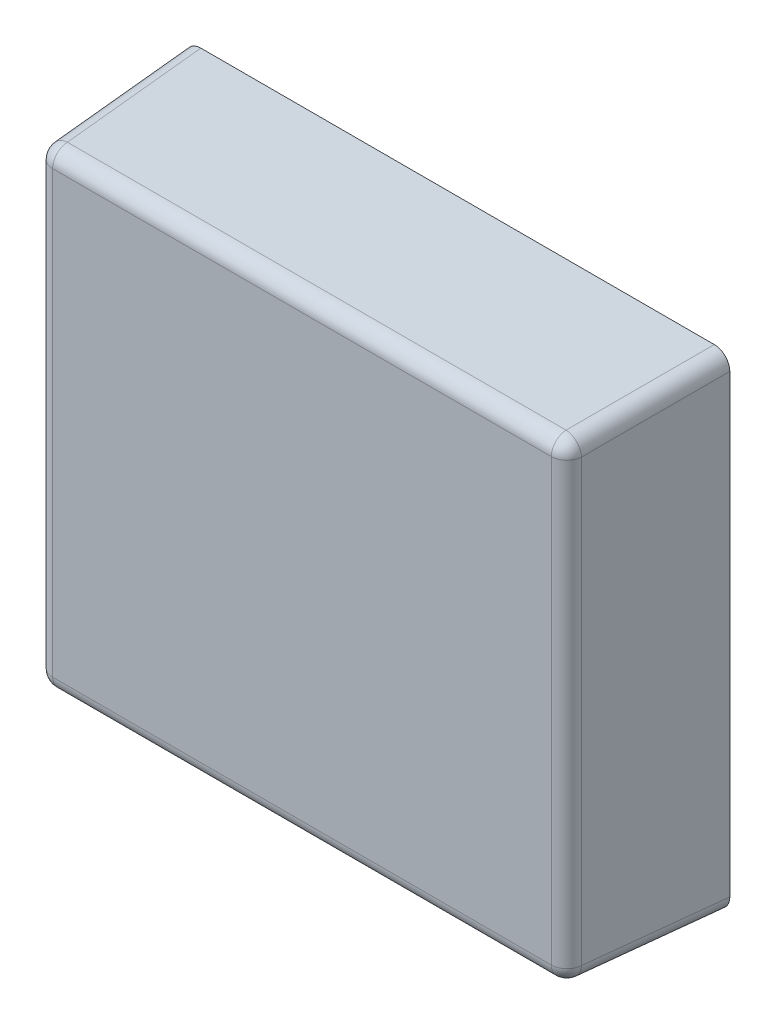
ISO-10303-21;
HEADER;
FILE_DESCRIPTION(('STEP AP214'),'2;1');
FILE_NAME('part.step','',(''),(''),'','','');
FILE_SCHEMA(('AUTOMOTIVE_DESIGN { 1 0 10303 214 1 1 1 1 }'));
ENDSEC;
DATA;
#1=APPLICATION_CONTEXT('core data for automotive mechanical design processes');
#2=APPLICATION_PROTOCOL_DEFINITION('international standard','automotive_design',2000,#1);
#3=PRODUCT_CONTEXT('',#1,'mechanical');
#4=PRODUCT('Part','Part','',(#3));
#5=PRODUCT_RELATED_PRODUCT_CATEGORY('part','',(#4));
#6=PRODUCT_DEFINITION_FORMATION('','',#4);
#7=PRODUCT_DEFINITION_CONTEXT('part definition',#1,'design');
#8=PRODUCT_DEFINITION('design','',#6,#7);
#9=PRODUCT_DEFINITION_SHAPE('','',#8);
#10=(LENGTH_UNIT() NAMED_UNIT(*) SI_UNIT(.MILLI.,.METRE.));
#11=(NAMED_UNIT(*) PLANE_ANGLE_UNIT() SI_UNIT($,.RADIAN.));
#12=(NAMED_UNIT(*) SI_UNIT($,.STERADIAN.) SOLID_ANGLE_UNIT());
#13=UNCERTAINTY_MEASURE_WITH_UNIT(LENGTH_MEASURE(1.E-05),#10,'distance_accuracy_value','');
#14=(GEOMETRIC_REPRESENTATION_CONTEXT(3) GLOBAL_UNCERTAINTY_ASSIGNED_CONTEXT((#13)) GLOBAL_UNIT_ASSIGNED_CONTEXT((#10,
#11,#12)) REPRESENTATION_CONTEXT('',''));
#15=CARTESIAN_POINT('',(0.,0.,0.));
#16=DIRECTION('',(0.,0.,1.));
#17=DIRECTION('',(1.,0.,0.));
#18=AXIS2_PLACEMENT_3D('',#15,#16,#17);
#19=CARTESIAN_POINT('',(0.658251832404,0.583251832404,0.03230958799243));
#20=DIRECTION('',(0.0522644276886878,0.0522644276887224,-0.997264688634238));
#21=DIRECTION('',(-0.998629534754575,0.,-0.0523359562429177));
#22=AXIS2_PLACEMENT_3D('',#19,#20,#21);
#23=CYLINDRICAL_SURFACE('',#22,0.04);
#24=CARTESIAN_POINT('',(0.641078305618,0.566078305618,0.36));
#25=DIRECTION('',(-0.0522644276886878,-0.0522644276887224,0.997264688634238));
#26=DIRECTION('',(0.998629534754575,0.,0.0523359562429177));
#27=AXIS2_PLACEMENT_3D('',#24,#25,#26);
#28=CIRCLE('',#27,0.04);
#29=CARTESIAN_POINT('',(0.681023487008,0.566078305618,0.36209343825));
#30=VERTEX_POINT('',#29);
#31=CARTESIAN_POINT('',(0.641078305618,0.606023487008,0.36209343825));
#32=VERTEX_POINT('',#31);
#33=EDGE_CURVE('E11',#30,#32,#28,.T.);
#34=ORIENTED_EDGE('',*,*,#33,.F.);
#35=DIRECTION('',(-0.0522644276887224,-0.0522644276887224,0.997264688634237));
#36=VECTOR('',#35,1.);
#37=CARTESIAN_POINT('',(0.698401881574,0.583456700184,0.03049391612672));
#38=LINE('',#37,#36);
#39=CARTESIAN_POINT('',(0.7,0.58505481861,0.));
#40=VERTEX_POINT('',#39);
#41=EDGE_CURVE('E167',#40,#30,#38,.T.);
#42=ORIENTED_EDGE('',*,*,#41,.F.);
#43=CARTESIAN_POINT('',(0.65994510616,0.58494510616,0.));
#44=DIRECTION('',(0.,0.,1.));
#45=DIRECTION('',(0.707106781186548,0.707106781186548,0.));
#46=AXIS2_PLACEMENT_3D('',#43,#44,#45);
#47=ELLIPSE('',#46,0.04010971255262,0.04);
#48=CARTESIAN_POINT('',(0.66005481861,0.625,0.));
#49=VERTEX_POINT('',#48);
#50=EDGE_CURVE('E133',#40,#49,#47,.T.);
#51=ORIENTED_EDGE('',*,*,#50,.T.);
#52=DIRECTION('',(-0.0522644276887224,-0.0522644276887224,0.997264688634237));
#53=VECTOR('',#52,1.);
#54=CARTESIAN_POINT('',(0.658251832404,0.623197013794,0.03440302624215));
#55=LINE('',#54,#53);
#56=EDGE_CURVE('E207',#49,#32,#55,.T.);
#57=ORIENTED_EDGE('',*,*,#56,.T.);
#58=EDGE_LOOP('',(#34,#42,#51,#57));
#59=FACE_BOUND('',#58,.T.);
#60=ADVANCED_FACE('F16',(#59),#23,.T.);
#61=CARTESIAN_POINT('',(0.641078305618,0.566078305618,0.36));
#62=DIRECTION('',(0.,0.,1.));
#63=DIRECTION('',(1.,0.,0.));
#64=AXIS2_PLACEMENT_3D('',#61,#62,#63);
#65=SPHERICAL_SURFACE('',#64,0.04);
#66=CARTESIAN_POINT('',(0.641078305618,0.566078305618,0.36));
#67=DIRECTION('',(1.,0.,0.));
#68=DIRECTION('',(0.,0.,-1.));
#69=AXIS2_PLACEMENT_3D('',#66,#67,#68);
#70=CIRCLE('',#69,0.04);
#71=CARTESIAN_POINT('',(0.641078305618,0.566078305618,0.4));
#72=VERTEX_POINT('',#71);
#73=EDGE_CURVE('E27',#32,#72,#70,.T.);
#74=ORIENTED_EDGE('',*,*,#73,.T.);
#75=CARTESIAN_POINT('',(0.641078305618,0.566078305618,0.36));
#76=DIRECTION('',(0.,1.,0.));
#77=DIRECTION('',(-1.,0.,0.));
#78=AXIS2_PLACEMENT_3D('',#75,#76,#77);
#79=CIRCLE('',#78,0.04);
#80=EDGE_CURVE('E138',#72,#30,#79,.T.);
#81=ORIENTED_EDGE('',*,*,#80,.T.);
#82=ORIENTED_EDGE('',*,*,#33,.T.);
#83=EDGE_LOOP('',(#74,#81,#82));
#84=FACE_BOUND('',#83,.T.);
#85=ADVANCED_FACE('F489',(#84),#65,.T.);
#86=CARTESIAN_POINT('',(-0.7,0.566078305618,0.36));
#87=DIRECTION('',(-1.,0.,0.));
#88=DIRECTION('',(0.,-1.,0.));
#89=AXIS2_PLACEMENT_3D('',#86,#87,#88);
#90=CYLINDRICAL_SURFACE('',#89,0.04);
#91=CARTESIAN_POINT('',(-0.641078305618,0.566078305618,0.36));
#92=DIRECTION('',(-1.,0.,0.));
#93=DIRECTION('',(0.,0.,1.));
#94=AXIS2_PLACEMENT_3D('',#91,#92,#93);
#95=CIRCLE('',#94,0.04);
#96=CARTESIAN_POINT('',(-0.641078305618,0.566078305618,0.4));
#97=VERTEX_POINT('',#96);
#98=CARTESIAN_POINT('',(-0.641078305618,0.606023487008,0.36209343825));
#99=VERTEX_POINT('',#98);
#100=EDGE_CURVE('E109',#97,#99,#95,.T.);
#101=ORIENTED_EDGE('',*,*,#100,.F.);
#102=DIRECTION('',(1.,0.,0.));
#103=VECTOR('',#102,1.);
#104=CARTESIAN_POINT('',(-0.679036888287,0.566078305618,0.4));
#105=LINE('',#104,#103);
#106=EDGE_CURVE('E141',#97,#72,#105,.T.);
#107=ORIENTED_EDGE('',*,*,#106,.T.);
#108=ORIENTED_EDGE('',*,*,#73,.F.);
#109=DIRECTION('',(-1.,0.,0.));
#110=VECTOR('',#109,1.);
#111=CARTESIAN_POINT('',(0.679036888287,0.606023487008,0.36209343825));
#112=LINE('',#111,#110);
#113=EDGE_CURVE('E211',#32,#99,#112,.T.);
#114=ORIENTED_EDGE('',*,*,#113,.T.);
#115=EDGE_LOOP('',(#101,#107,#108,#114));
#116=FACE_BOUND('',#115,.T.);
#117=ADVANCED_FACE('F480',(#116),#90,.T.);
#118=CARTESIAN_POINT('',(0.641078305618,-0.625,0.36));
#119=DIRECTION('',(0.,1.,0.));
#120=DIRECTION('',(-1.,0.,0.));
#121=AXIS2_PLACEMENT_3D('',#118,#119,#120);
#122=CYLINDRICAL_SURFACE('',#121,0.04);
#123=CARTESIAN_POINT('',(0.641078305618,-0.566078305618,0.36));
#124=DIRECTION('',(0.,-1.,0.));
#125=DIRECTION('',(0.,0.,-1.));
#126=AXIS2_PLACEMENT_3D('',#123,#124,#125);
#127=CIRCLE('',#126,0.04);
#128=CARTESIAN_POINT('',(0.681023487008,-0.566078305618,0.36209343825));
#129=VERTEX_POINT('',#128);
#130=CARTESIAN_POINT('',(0.641078305618,-0.566078305618,0.4));
#131=VERTEX_POINT('',#130);
#132=EDGE_CURVE('E97',#129,#131,#127,.T.);
#133=ORIENTED_EDGE('',*,*,#132,.F.);
#134=DIRECTION('',(0.,1.,0.));
#135=VECTOR('',#134,1.);
#136=CARTESIAN_POINT('',(0.681023487008,-0.604036888287,0.36209343825));
#137=LINE('',#136,#135);
#138=EDGE_CURVE('E163',#129,#30,#137,.T.);
#139=ORIENTED_EDGE('',*,*,#138,.T.);
#140=ORIENTED_EDGE('',*,*,#80,.F.);
#141=DIRECTION('',(0.,-1.,0.));
#142=VECTOR('',#141,1.);
#143=CARTESIAN_POINT('',(0.641078305618,0.604036888287,0.4));
#144=LINE('',#143,#142);
#145=EDGE_CURVE('E129',#72,#131,#144,.T.);
#146=ORIENTED_EDGE('',*,*,#145,.T.);
#147=EDGE_LOOP('',(#133,#139,#140,#146));
#148=FACE_BOUND('',#147,.T.);
#149=ADVANCED_FACE('F136',(#148),#122,.T.);
#150=CARTESIAN_POINT('',(-0.641078305618,0.566078305618,0.36));
#151=DIRECTION('',(0.,0.,1.));
#152=DIRECTION('',(1.,0.,0.));
#153=AXIS2_PLACEMENT_3D('',#150,#151,#152);
#154=SPHERICAL_SURFACE('',#153,0.04);
#155=CARTESIAN_POINT('',(-0.641078305618,0.566078305618,0.36));
#156=DIRECTION('',(0.0522644276886878,-0.0522644276887224,0.997264688634238));
#157=DIRECTION('',(0.998629534754575,0.,-0.0523359562429177));
#158=AXIS2_PLACEMENT_3D('',#155,#156,#157);
#159=CIRCLE('',#158,0.04);
#160=CARTESIAN_POINT('',(-0.681023487008,0.566078305618,0.36209343825));
#161=VERTEX_POINT('',#160);
#162=EDGE_CURVE('E110',#99,#161,#159,.T.);
#163=ORIENTED_EDGE('',*,*,#162,.T.);
#164=CARTESIAN_POINT('',(-0.641078305618,0.566078305618,0.36));
#165=DIRECTION('',(0.,1.,0.));
#166=DIRECTION('',(0.,0.,1.));
#167=AXIS2_PLACEMENT_3D('',#164,#165,#166);
#168=CIRCLE('',#167,0.04);
#169=EDGE_CURVE('E123',#161,#97,#168,.T.);
#170=ORIENTED_EDGE('',*,*,#169,.T.);
#171=ORIENTED_EDGE('',*,*,#100,.T.);
#172=EDGE_LOOP('',(#163,#170,#171));
#173=FACE_BOUND('',#172,.T.);
#174=ADVANCED_FACE('F462',(#173),#154,.T.);
#175=CARTESIAN_POINT('',(0.641078305618,-0.566078305618,0.36));
#176=DIRECTION('',(0.,0.,1.));
#177=DIRECTION('',(1.,0.,0.));
#178=AXIS2_PLACEMENT_3D('',#175,#176,#177);
#179=SPHERICAL_SURFACE('',#178,0.04);
#180=CARTESIAN_POINT('',(0.641078305618,-0.566078305618,0.36));
#181=DIRECTION('',(1.,0.,0.));
#182=DIRECTION('',(0.,1.,0.));
#183=AXIS2_PLACEMENT_3D('',#180,#181,#182);
#184=CIRCLE('',#183,0.04);
#185=CARTESIAN_POINT('',(0.641078305618,-0.606023487008,0.36209343825));
#186=VERTEX_POINT('',#185);
#187=EDGE_CURVE('E101',#131,#186,#184,.T.);
#188=ORIENTED_EDGE('',*,*,#187,.T.);
#189=CARTESIAN_POINT('',(0.641078305618,-0.566078305618,0.36));
#190=DIRECTION('',(-0.0522644276886878,0.0522644276887224,0.997264688634238));
#191=DIRECTION('',(0.998629534754575,0.,0.0523359562429177));
#192=AXIS2_PLACEMENT_3D('',#189,#190,#191);
#193=CIRCLE('',#192,0.04);
#194=EDGE_CURVE('E103',#186,#129,#193,.T.);
#195=ORIENTED_EDGE('',*,*,#194,.T.);
#196=ORIENTED_EDGE('',*,*,#132,.T.);
#197=EDGE_LOOP('',(#188,#195,#196));
#198=FACE_BOUND('',#197,.T.);
#199=ADVANCED_FACE('F99',(#198),#179,.T.);
#200=CARTESIAN_POINT('',(-0.658456700184,0.583456700184,0.02840047787701));
#201=DIRECTION('',(-0.0522644276887224,0.0522644276886878,-0.997264688634238));
#202=DIRECTION('',(0.,0.998629534754575,0.0523359562429177));
#203=AXIS2_PLACEMENT_3D('',#200,#201,#202);
#204=CYLINDRICAL_SURFACE('',#203,0.04);
#205=CARTESIAN_POINT('',(-0.65994510616,0.58494510616,0.));
#206=DIRECTION('',(0.,0.,1.));
#207=DIRECTION('',(-0.707106781186548,0.707106781186548,0.));
#208=AXIS2_PLACEMENT_3D('',#205,#206,#207);
#209=ELLIPSE('',#208,0.04010971255262,0.04);
#210=CARTESIAN_POINT('',(-0.66005481861,0.625,0.));
#211=VERTEX_POINT('',#210);
#212=CARTESIAN_POINT('',(-0.7,0.58505481861,0.));
#213=VERTEX_POINT('',#212);
#214=EDGE_CURVE('E155',#211,#213,#209,.T.);
#215=ORIENTED_EDGE('',*,*,#214,.T.);
#216=DIRECTION('',(0.0522644276887224,-0.0522644276887224,0.997264688634237));
#217=VECTOR('',#216,1.);
#218=CARTESIAN_POINT('',(-0.698401881574,0.583456700184,0.03049391612672));
#219=LINE('',#218,#217);
#220=EDGE_CURVE('E157',#213,#161,#219,.T.);
#221=ORIENTED_EDGE('',*,*,#220,.T.);
#222=ORIENTED_EDGE('',*,*,#162,.F.);
#223=DIRECTION('',(0.0522644276887224,-0.0522644276887224,0.997264688634237));
#224=VECTOR('',#223,1.);
#225=CARTESIAN_POINT('',(-0.658251832404,0.623197013794,0.03440302624215));
#226=LINE('',#225,#224);
#227=EDGE_CURVE('E142',#211,#99,#226,.T.);
#228=ORIENTED_EDGE('',*,*,#227,.F.);
#229=EDGE_LOOP('',(#215,#221,#222,#228));
#230=FACE_BOUND('',#229,.T.);
#231=ADVANCED_FACE('F441',(#230),#204,.T.);
#232=CARTESIAN_POINT('',(-0.641078305618,-0.625,0.36));
#233=DIRECTION('',(0.,-1.,0.));
#234=DIRECTION('',(0.,0.,-1.));
#235=AXIS2_PLACEMENT_3D('',#232,#233,#234);
#236=CYLINDRICAL_SURFACE('',#235,0.04);
#237=CARTESIAN_POINT('',(-0.641078305618,-0.566078305618,0.36));
#238=DIRECTION('',(0.,-1.,0.));
#239=DIRECTION('',(0.,0.,-1.));
#240=AXIS2_PLACEMENT_3D('',#237,#238,#239);
#241=CIRCLE('',#240,0.04);
#242=CARTESIAN_POINT('',(-0.641078305618,-0.566078305618,0.4));
#243=VERTEX_POINT('',#242);
#244=CARTESIAN_POINT('',(-0.681023487008,-0.566078305618,0.36209343825));
#245=VERTEX_POINT('',#244);
#246=EDGE_CURVE('E170',#243,#245,#241,.T.);
#247=ORIENTED_EDGE('',*,*,#246,.F.);
#248=DIRECTION('',(0.,1.,0.));
#249=VECTOR('',#248,1.);
#250=CARTESIAN_POINT('',(-0.641078305618,-0.604036888287,0.4));
#251=LINE('',#250,#249);
#252=EDGE_CURVE('E131',#243,#97,#251,.T.);
#253=ORIENTED_EDGE('',*,*,#252,.T.);
#254=ORIENTED_EDGE('',*,*,#169,.F.);
#255=DIRECTION('',(0.,-1.,0.));
#256=VECTOR('',#255,1.);
#257=CARTESIAN_POINT('',(-0.681023487008,0.604036888287,0.36209343825));
#258=LINE('',#257,#256);
#259=EDGE_CURVE('E162',#161,#245,#258,.T.);
#260=ORIENTED_EDGE('',*,*,#259,.T.);
#261=EDGE_LOOP('',(#247,#253,#254,#260));
#262=FACE_BOUND('',#261,.T.);
#263=ADVANCED_FACE('F431',(#262),#236,.T.);
#264=CARTESIAN_POINT('',(-0.7,-0.566078305618,0.36));
#265=DIRECTION('',(1.,0.,0.));
#266=DIRECTION('',(0.,1.,0.));
#267=AXIS2_PLACEMENT_3D('',#264,#265,#266);
#268=CYLINDRICAL_SURFACE('',#267,0.04);
#269=CARTESIAN_POINT('',(-0.641078305618,-0.566078305618,0.36));
#270=DIRECTION('',(-1.,0.,0.));
#271=DIRECTION('',(0.,0.,1.));
#272=AXIS2_PLACEMENT_3D('',#269,#270,#271);
#273=CIRCLE('',#272,0.04);
#274=CARTESIAN_POINT('',(-0.641078305618,-0.606023487008,0.36209343825));
#275=VERTEX_POINT('',#274);
#276=EDGE_CURVE('E41',#275,#243,#273,.T.);
#277=ORIENTED_EDGE('',*,*,#276,.F.);
#278=DIRECTION('',(1.,0.,0.));
#279=VECTOR('',#278,1.);
#280=CARTESIAN_POINT('',(-0.679036888287,-0.606023487008,0.36209343825));
#281=LINE('',#280,#279);
#282=EDGE_CURVE('E120',#275,#186,#281,.T.);
#283=ORIENTED_EDGE('',*,*,#282,.T.);
#284=ORIENTED_EDGE('',*,*,#187,.F.);
#285=DIRECTION('',(-1.,0.,0.));
#286=VECTOR('',#285,1.);
#287=CARTESIAN_POINT('',(0.679036888287,-0.566078305618,0.4));
#288=LINE('',#287,#286);
#289=EDGE_CURVE('E117',#131,#243,#288,.T.);
#290=ORIENTED_EDGE('',*,*,#289,.T.);
#291=EDGE_LOOP('',(#277,#283,#284,#290));
#292=FACE_BOUND('',#291,.T.);
#293=ADVANCED_FACE('F116',(#292),#268,.T.);
#294=CARTESIAN_POINT('',(0.658456700184,-0.583456700184,0.02840047787701));
#295=DIRECTION('',(0.0522644276887224,-0.0522644276886878,-0.997264688634238));
#296=DIRECTION('',(0.,0.998629534754575,-0.0523359562429177));
#297=AXIS2_PLACEMENT_3D('',#294,#295,#296);
#298=CYLINDRICAL_SURFACE('',#297,0.04);
#299=CARTESIAN_POINT('',(0.65994510616,-0.58494510616,0.));
#300=DIRECTION('',(0.,0.,1.));
#301=DIRECTION('',(0.707106781186548,-0.707106781186548,0.));
#302=AXIS2_PLACEMENT_3D('',#299,#300,#301);
#303=ELLIPSE('',#302,0.04010971255262,0.04);
#304=CARTESIAN_POINT('',(0.66005481861,-0.625,0.));
#305=VERTEX_POINT('',#304);
#306=CARTESIAN_POINT('',(0.7,-0.58505481861,0.));
#307=VERTEX_POINT('',#306);
#308=EDGE_CURVE('E175',#305,#307,#303,.T.);
#309=ORIENTED_EDGE('',*,*,#308,.T.);
#310=DIRECTION('',(-0.0522644276887224,0.0522644276887224,0.997264688634237));
#311=VECTOR('',#310,1.);
#312=CARTESIAN_POINT('',(0.698401881574,-0.583456700184,0.03049391612672));
#313=LINE('',#312,#311);
#314=EDGE_CURVE('E166',#307,#129,#313,.T.);
#315=ORIENTED_EDGE('',*,*,#314,.T.);
#316=ORIENTED_EDGE('',*,*,#194,.F.);
#317=DIRECTION('',(-0.0522644276887224,0.0522644276887224,0.997264688634237));
#318=VECTOR('',#317,1.);
#319=CARTESIAN_POINT('',(0.658251832404,-0.623197013794,0.03440302624215));
#320=LINE('',#319,#318);
#321=EDGE_CURVE('E180',#305,#186,#320,.T.);
#322=ORIENTED_EDGE('',*,*,#321,.F.);
#323=EDGE_LOOP('',(#309,#315,#316,#322));
#324=FACE_BOUND('',#323,.T.);
#325=ADVANCED_FACE('F413',(#324),#298,.T.);
#326=CARTESIAN_POINT('',(-0.641078305618,-0.566078305618,0.36));
#327=DIRECTION('',(0.,0.,1.));
#328=DIRECTION('',(1.,0.,0.));
#329=AXIS2_PLACEMENT_3D('',#326,#327,#328);
#330=SPHERICAL_SURFACE('',#329,0.04);
#331=ORIENTED_EDGE('',*,*,#246,.T.);
#332=CARTESIAN_POINT('',(-0.641078305618,-0.566078305618,0.36));
#333=DIRECTION('',(0.0522644276886878,0.0522644276887224,0.997264688634238));
#334=DIRECTION('',(0.998629534754575,0.,-0.0523359562429177));
#335=AXIS2_PLACEMENT_3D('',#332,#333,#334);
#336=CIRCLE('',#335,0.04);
#337=EDGE_CURVE('E168',#245,#275,#336,.T.);
#338=ORIENTED_EDGE('',*,*,#337,.T.);
#339=ORIENTED_EDGE('',*,*,#276,.T.);
#340=EDGE_LOOP('',(#331,#338,#339));
#341=FACE_BOUND('',#340,.T.);
#342=ADVANCED_FACE('F403',(#341),#330,.T.);
#343=CARTESIAN_POINT('',(-0.658251832404,-0.583251832404,0.03230958799243));
#344=DIRECTION('',(-0.0522644276886878,-0.0522644276887224,-0.997264688634238));
#345=DIRECTION('',(-0.998629534754575,0.,0.0523359562429177));
#346=AXIS2_PLACEMENT_3D('',#343,#344,#345);
#347=CYLINDRICAL_SURFACE('',#346,0.04);
#348=ORIENTED_EDGE('',*,*,#337,.F.);
#349=DIRECTION('',(0.0522644276887224,0.0522644276887224,0.997264688634237));
#350=VECTOR('',#349,1.);
#351=CARTESIAN_POINT('',(-0.698401881574,-0.583456700184,0.03049391612672));
#352=LINE('',#351,#350);
#353=CARTESIAN_POINT('',(-0.7,-0.58505481861,0.));
#354=VERTEX_POINT('',#353);
#355=EDGE_CURVE('E178',#354,#245,#352,.T.);
#356=ORIENTED_EDGE('',*,*,#355,.F.);
#357=CARTESIAN_POINT('',(-0.65994510616,-0.58494510616,0.));
#358=DIRECTION('',(0.,0.,1.));
#359=DIRECTION('',(-0.707106781186548,-0.707106781186548,0.));
#360=AXIS2_PLACEMENT_3D('',#357,#358,#359);
#361=ELLIPSE('',#360,0.04010971255262,0.04);
#362=CARTESIAN_POINT('',(-0.66005481861,-0.625,0.));
#363=VERTEX_POINT('',#362);
#364=EDGE_CURVE('E214',#354,#363,#361,.T.);
#365=ORIENTED_EDGE('',*,*,#364,.T.);
#366=DIRECTION('',(0.0522644276887224,0.0522644276887224,0.997264688634237));
#367=VECTOR('',#366,1.);
#368=CARTESIAN_POINT('',(-0.658251832404,-0.623197013794,0.03440302624215));
#369=LINE('',#368,#367);
#370=EDGE_CURVE('E20',#363,#275,#369,.T.);
#371=ORIENTED_EDGE('',*,*,#370,.T.);
#372=EDGE_LOOP('',(#348,#356,#365,#371));
#373=FACE_BOUND('',#372,.T.);
#374=ADVANCED_FACE('F392',(#373),#347,.T.);
#375=CARTESIAN_POINT('',(-0.7,-0.625,0.));
#376=DIRECTION('',(0.,0.,1.));
#377=DIRECTION('',(1.,0.,0.));
#378=AXIS2_PLACEMENT_3D('',#375,#376,#377);
#379=PLANE('',#378);
#380=DIRECTION('',(1.,0.,0.));
#381=VECTOR('',#380,1.);
#382=CARTESIAN_POINT('',(0.,0.625,0.));
#383=LINE('',#382,#381);
#384=EDGE_CURVE('E151',#211,#49,#383,.T.);
#385=ORIENTED_EDGE('',*,*,#384,.T.);
#386=ORIENTED_EDGE('',*,*,#50,.F.);
#387=DIRECTION('',(0.,-1.,0.));
#388=VECTOR('',#387,1.);
#389=CARTESIAN_POINT('',(0.7,0.,0.));
#390=LINE('',#389,#388);
#391=EDGE_CURVE('E186',#40,#307,#390,.T.);
#392=ORIENTED_EDGE('',*,*,#391,.T.);
#393=ORIENTED_EDGE('',*,*,#308,.F.);
#394=DIRECTION('',(-1.,0.,0.));
#395=VECTOR('',#394,1.);
#396=CARTESIAN_POINT('',(0.,-0.625,0.));
#397=LINE('',#396,#395);
#398=EDGE_CURVE('E187',#305,#363,#397,.T.);
#399=ORIENTED_EDGE('',*,*,#398,.T.);
#400=ORIENTED_EDGE('',*,*,#364,.F.);
#401=DIRECTION('',(0.,1.,0.));
#402=VECTOR('',#401,1.);
#403=CARTESIAN_POINT('',(-0.7,0.,0.));
#404=LINE('',#403,#402);
#405=EDGE_CURVE('E161',#354,#213,#404,.T.);
#406=ORIENTED_EDGE('',*,*,#405,.T.);
#407=ORIENTED_EDGE('',*,*,#214,.F.);
#408=EDGE_LOOP('',(#385,#386,#392,#393,#399,#400,#406,#407));
#409=FACE_BOUND('',#408,.T.);
#410=ADVANCED_FACE('F381',(#409),#379,.F.);
#411=CARTESIAN_POINT('',(-0.7,-0.625,0.4));
#412=DIRECTION('',(0.,0.,1.));
#413=DIRECTION('',(1.,0.,0.));
#414=AXIS2_PLACEMENT_3D('',#411,#412,#413);
#415=PLANE('',#414);
#416=ORIENTED_EDGE('',*,*,#145,.F.);
#417=ORIENTED_EDGE('',*,*,#106,.F.);
#418=ORIENTED_EDGE('',*,*,#252,.F.);
#419=ORIENTED_EDGE('',*,*,#289,.F.);
#420=EDGE_LOOP('',(#416,#417,#418,#419));
#421=FACE_BOUND('',#420,.T.);
#422=ADVANCED_FACE('F127',(#421),#415,.T.);
#423=CARTESIAN_POINT('',(0.,0.625,0.));
#424=DIRECTION('',(0.,0.998629534754575,0.0523359562429177));
#425=DIRECTION('',(1.,0.,0.));
#426=AXIS2_PLACEMENT_3D('',#423,#424,#425);
#427=PLANE('',#426);
#428=ORIENTED_EDGE('',*,*,#113,.F.);
#429=ORIENTED_EDGE('',*,*,#56,.F.);
#430=ORIENTED_EDGE('',*,*,#384,.F.);
#431=ORIENTED_EDGE('',*,*,#227,.T.);
#432=EDGE_LOOP('',(#428,#429,#430,#431));
#433=FACE_BOUND('',#432,.T.);
#434=ADVANCED_FACE('F18',(#433),#427,.T.);
#435=CARTESIAN_POINT('',(0.7,0.,0.));
#436=DIRECTION('',(0.998629534754575,0.,0.0523359562429177));
#437=DIRECTION('',(0.,-1.,0.));
#438=AXIS2_PLACEMENT_3D('',#435,#436,#437);
#439=PLANE('',#438);
#440=ORIENTED_EDGE('',*,*,#391,.F.);
#441=ORIENTED_EDGE('',*,*,#41,.T.);
#442=ORIENTED_EDGE('',*,*,#138,.F.);
#443=ORIENTED_EDGE('',*,*,#314,.F.);
#444=EDGE_LOOP('',(#440,#441,#442,#443));
#445=FACE_BOUND('',#444,.T.);
#446=ADVANCED_FACE('F347',(#445),#439,.T.);
#447=CARTESIAN_POINT('',(0.,-0.625,0.));
#448=DIRECTION('',(0.,-0.998629534754575,0.0523359562429177));
#449=DIRECTION('',(-1.,0.,0.));
#450=AXIS2_PLACEMENT_3D('',#447,#448,#449);
#451=PLANE('',#450);
#452=ORIENTED_EDGE('',*,*,#398,.F.);
#453=ORIENTED_EDGE('',*,*,#321,.T.);
#454=ORIENTED_EDGE('',*,*,#282,.F.);
#455=ORIENTED_EDGE('',*,*,#370,.F.);
#456=EDGE_LOOP('',(#452,#453,#454,#455));
#457=FACE_BOUND('',#456,.T.);
#458=ADVANCED_FACE('F333',(#457),#451,.T.);
#459=CARTESIAN_POINT('',(-0.7,0.,0.));
#460=DIRECTION('',(-0.998629534754575,0.,0.0523359562429177));
#461=DIRECTION('',(0.,1.,0.));
#462=AXIS2_PLACEMENT_3D('',#459,#460,#461);
#463=PLANE('',#462);
#464=ORIENTED_EDGE('',*,*,#259,.F.);
#465=ORIENTED_EDGE('',*,*,#220,.F.);
#466=ORIENTED_EDGE('',*,*,#405,.F.);
#467=ORIENTED_EDGE('',*,*,#355,.T.);
#468=EDGE_LOOP('',(#464,#465,#466,#467));
#469=FACE_BOUND('',#468,.T.);
#470=ADVANCED_FACE('F327',(#469),#463,.T.);
#471=CLOSED_SHELL('',(#60,#85,#117,#149,#174,#199,#231,#263,#293,#325,#342,#374,#410,#422,#434,
#446,#458,#470));
#472=MANIFOLD_SOLID_BREP('B1',#471);
#473=ADVANCED_BREP_SHAPE_REPRESENTATION('',(#18,#472),#14);
#474=SHAPE_DEFINITION_REPRESENTATION(#9,#473);
ENDSEC;
END-ISO-10303-21;
